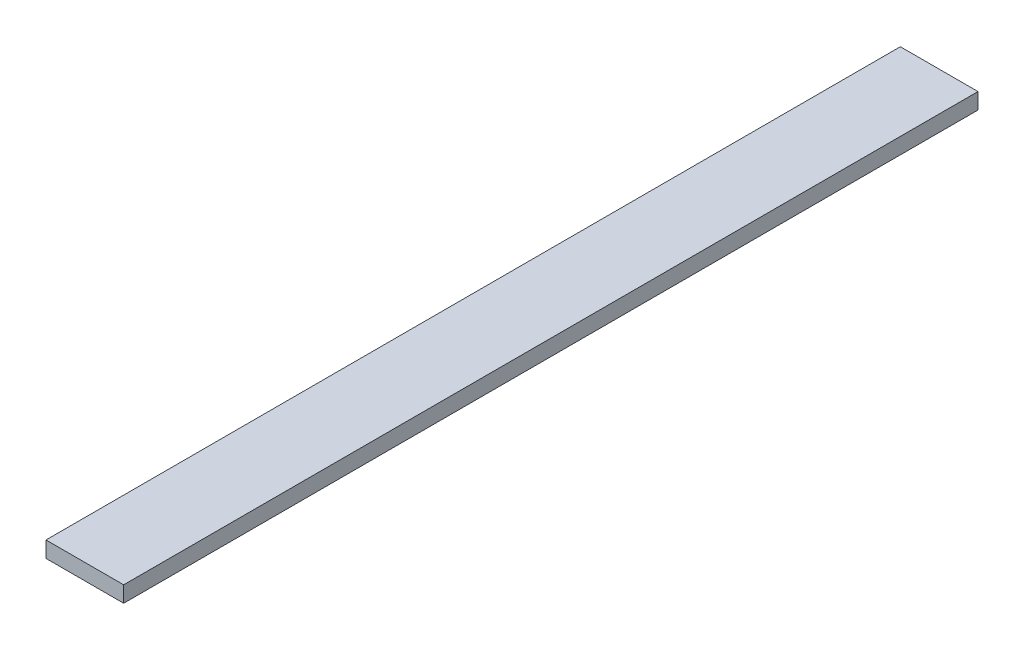
ISO-10303-21;
HEADER;
FILE_DESCRIPTION(('STEP AP214'),'2;1');
FILE_NAME('part.step','',(''),(''),'','','');
FILE_SCHEMA(('AUTOMOTIVE_DESIGN { 1 0 10303 214 1 1 1 1 }'));
ENDSEC;
DATA;
#1=APPLICATION_CONTEXT('core data for automotive mechanical design processes');
#2=APPLICATION_PROTOCOL_DEFINITION('international standard','automotive_design',2000,#1);
#3=PRODUCT_CONTEXT('',#1,'mechanical');
#4=PRODUCT('Part','Part','',(#3));
#5=PRODUCT_RELATED_PRODUCT_CATEGORY('part','',(#4));
#6=PRODUCT_DEFINITION_FORMATION('','',#4);
#7=PRODUCT_DEFINITION_CONTEXT('part definition',#1,'design');
#8=PRODUCT_DEFINITION('design','',#6,#7);
#9=PRODUCT_DEFINITION_SHAPE('','',#8);
#10=(LENGTH_UNIT() NAMED_UNIT(*) SI_UNIT(.MILLI.,.METRE.));
#11=(NAMED_UNIT(*) PLANE_ANGLE_UNIT() SI_UNIT($,.RADIAN.));
#12=(NAMED_UNIT(*) SI_UNIT($,.STERADIAN.) SOLID_ANGLE_UNIT());
#13=UNCERTAINTY_MEASURE_WITH_UNIT(LENGTH_MEASURE(1.E-05),#10,'distance_accuracy_value','');
#14=(GEOMETRIC_REPRESENTATION_CONTEXT(3) GLOBAL_UNCERTAINTY_ASSIGNED_CONTEXT((#13)) GLOBAL_UNIT_ASSIGNED_CONTEXT((#10,
#11,#12)) REPRESENTATION_CONTEXT('',''));
#15=CARTESIAN_POINT('',(0.,0.,0.));
#16=DIRECTION('',(0.,0.,1.));
#17=DIRECTION('',(1.,0.,0.));
#18=AXIS2_PLACEMENT_3D('',#15,#16,#17);
#19=CARTESIAN_POINT('',(0.,4.7625,0.));
#20=DIRECTION('',(1.,0.,0.));
#21=DIRECTION('',(0.,0.,-1.));
#22=AXIS2_PLACEMENT_3D('',#19,#20,#21);
#23=PLANE('',#22);
#24=DIRECTION('',(0.,0.,1.));
#25=VECTOR('',#24,1.);
#26=CARTESIAN_POINT('',(0.,0.,0.));
#27=LINE('',#26,#25);
#28=CARTESIAN_POINT('',(0.,0.,0.));
#29=VERTEX_POINT('',#28);
#30=CARTESIAN_POINT('',(0.,0.,254.));
#31=VERTEX_POINT('',#30);
#32=EDGE_CURVE('E96',#29,#31,#27,.T.);
#33=ORIENTED_EDGE('',*,*,#32,.T.);
#34=DIRECTION('',(0.,-1.,0.));
#35=VECTOR('',#34,1.);
#36=CARTESIAN_POINT('',(0.,4.7625,254.));
#37=LINE('',#36,#35);
#38=CARTESIAN_POINT('',(0.,4.7625,254.));
#39=VERTEX_POINT('',#38);
#40=EDGE_CURVE('E11',#39,#31,#37,.T.);
#41=ORIENTED_EDGE('',*,*,#40,.F.);
#42=DIRECTION('',(0.,0.,1.));
#43=VECTOR('',#42,1.);
#44=CARTESIAN_POINT('',(0.,4.7625,0.));
#45=LINE('',#44,#43);
#46=CARTESIAN_POINT('',(0.,4.7625,0.));
#47=VERTEX_POINT('',#46);
#48=EDGE_CURVE('E82',#47,#39,#45,.T.);
#49=ORIENTED_EDGE('',*,*,#48,.F.);
#50=DIRECTION('',(0.,-1.,0.));
#51=VECTOR('',#50,1.);
#52=CARTESIAN_POINT('',(0.,4.7625,0.));
#53=LINE('',#52,#51);
#54=EDGE_CURVE('E49',#47,#29,#53,.T.);
#55=ORIENTED_EDGE('',*,*,#54,.T.);
#56=EDGE_LOOP('',(#33,#41,#49,#55));
#57=FACE_BOUND('',#56,.T.);
#58=ADVANCED_FACE('F33',(#57),#23,.F.);
#59=CARTESIAN_POINT('',(0.,4.7625,254.));
#60=DIRECTION('',(0.,0.,-1.));
#61=DIRECTION('',(-1.,0.,0.));
#62=AXIS2_PLACEMENT_3D('',#59,#60,#61);
#63=PLANE('',#62);
#64=DIRECTION('',(1.,0.,0.));
#65=VECTOR('',#64,1.);
#66=CARTESIAN_POINT('',(0.,0.,254.));
#67=LINE('',#66,#65);
#68=CARTESIAN_POINT('',(23.0909090909091,0.,254.));
#69=VERTEX_POINT('',#68);
#70=EDGE_CURVE('E87',#31,#69,#67,.T.);
#71=ORIENTED_EDGE('',*,*,#70,.T.);
#72=DIRECTION('',(0.,-1.,0.));
#73=VECTOR('',#72,1.);
#74=CARTESIAN_POINT('',(23.0909090909091,4.7625,254.));
#75=LINE('',#74,#73);
#76=CARTESIAN_POINT('',(23.0909090909091,4.7625,254.));
#77=VERTEX_POINT('',#76);
#78=EDGE_CURVE('E41',#77,#69,#75,.T.);
#79=ORIENTED_EDGE('',*,*,#78,.F.);
#80=DIRECTION('',(1.,0.,0.));
#81=VECTOR('',#80,1.);
#82=CARTESIAN_POINT('',(0.,4.7625,254.));
#83=LINE('',#82,#81);
#84=EDGE_CURVE('E74',#39,#77,#83,.T.);
#85=ORIENTED_EDGE('',*,*,#84,.F.);
#86=ORIENTED_EDGE('',*,*,#40,.T.);
#87=EDGE_LOOP('',(#71,#79,#85,#86));
#88=FACE_BOUND('',#87,.T.);
#89=ADVANCED_FACE('F86',(#88),#63,.F.);
#90=CARTESIAN_POINT('',(23.0909090909091,4.7625,0.));
#91=DIRECTION('',(1.,0.,0.));
#92=DIRECTION('',(0.,0.,-1.));
#93=AXIS2_PLACEMENT_3D('',#90,#91,#92);
#94=PLANE('',#93);
#95=DIRECTION('',(0.,0.,1.));
#96=VECTOR('',#95,1.);
#97=CARTESIAN_POINT('',(23.0909090909091,0.,0.));
#98=LINE('',#97,#96);
#99=CARTESIAN_POINT('',(23.0909090909091,0.,0.));
#100=VERTEX_POINT('',#99);
#101=EDGE_CURVE('E99',#100,#69,#98,.T.);
#102=ORIENTED_EDGE('',*,*,#101,.F.);
#103=DIRECTION('',(0.,-1.,0.));
#104=VECTOR('',#103,1.);
#105=CARTESIAN_POINT('',(23.0909090909091,4.7625,0.));
#106=LINE('',#105,#104);
#107=CARTESIAN_POINT('',(23.0909090909091,4.7625,0.));
#108=VERTEX_POINT('',#107);
#109=EDGE_CURVE('E63',#108,#100,#106,.T.);
#110=ORIENTED_EDGE('',*,*,#109,.F.);
#111=DIRECTION('',(0.,0.,1.));
#112=VECTOR('',#111,1.);
#113=CARTESIAN_POINT('',(23.0909090909091,4.7625,0.));
#114=LINE('',#113,#112);
#115=EDGE_CURVE('E81',#108,#77,#114,.T.);
#116=ORIENTED_EDGE('',*,*,#115,.T.);
#117=ORIENTED_EDGE('',*,*,#78,.T.);
#118=EDGE_LOOP('',(#102,#110,#116,#117));
#119=FACE_BOUND('',#118,.T.);
#120=ADVANCED_FACE('F90',(#119),#94,.T.);
#121=CARTESIAN_POINT('',(0.,4.7625,0.));
#122=DIRECTION('',(0.,0.,-1.));
#123=DIRECTION('',(-1.,0.,0.));
#124=AXIS2_PLACEMENT_3D('',#121,#122,#123);
#125=PLANE('',#124);
#126=DIRECTION('',(1.,0.,0.));
#127=VECTOR('',#126,1.);
#128=CARTESIAN_POINT('',(0.,0.,0.));
#129=LINE('',#128,#127);
#130=EDGE_CURVE('E101',#29,#100,#129,.T.);
#131=ORIENTED_EDGE('',*,*,#130,.F.);
#132=ORIENTED_EDGE('',*,*,#54,.F.);
#133=DIRECTION('',(1.,0.,0.));
#134=VECTOR('',#133,1.);
#135=CARTESIAN_POINT('',(0.,4.7625,0.));
#136=LINE('',#135,#134);
#137=EDGE_CURVE('E91',#47,#108,#136,.T.);
#138=ORIENTED_EDGE('',*,*,#137,.T.);
#139=ORIENTED_EDGE('',*,*,#109,.T.);
#140=EDGE_LOOP('',(#131,#132,#138,#139));
#141=FACE_BOUND('',#140,.T.);
#142=ADVANCED_FACE('F107',(#141),#125,.T.);
#143=CARTESIAN_POINT('',(0.,4.7625,0.));
#144=DIRECTION('',(0.,1.,0.));
#145=DIRECTION('',(0.,0.,1.));
#146=AXIS2_PLACEMENT_3D('',#143,#144,#145);
#147=PLANE('',#146);
#148=ORIENTED_EDGE('',*,*,#48,.T.);
#149=ORIENTED_EDGE('',*,*,#84,.T.);
#150=ORIENTED_EDGE('',*,*,#115,.F.);
#151=ORIENTED_EDGE('',*,*,#137,.F.);
#152=EDGE_LOOP('',(#148,#149,#150,#151));
#153=FACE_BOUND('',#152,.T.);
#154=ADVANCED_FACE('F78',(#153),#147,.T.);
#155=CARTESIAN_POINT('',(0.,0.,0.));
#156=DIRECTION('',(0.,1.,0.));
#157=DIRECTION('',(0.,0.,1.));
#158=AXIS2_PLACEMENT_3D('',#155,#156,#157);
#159=PLANE('',#158);
#160=ORIENTED_EDGE('',*,*,#32,.F.);
#161=ORIENTED_EDGE('',*,*,#130,.T.);
#162=ORIENTED_EDGE('',*,*,#101,.T.);
#163=ORIENTED_EDGE('',*,*,#70,.F.);
#164=EDGE_LOOP('',(#160,#161,#162,#163));
#165=FACE_BOUND('',#164,.T.);
#166=ADVANCED_FACE('F106',(#165),#159,.F.);
#167=CLOSED_SHELL('',(#58,#89,#120,#142,#154,#166));
#168=MANIFOLD_SOLID_BREP('B2',#167);
#169=ADVANCED_BREP_SHAPE_REPRESENTATION('',(#18,#168),#14);
#170=SHAPE_DEFINITION_REPRESENTATION(#9,#169);
ENDSEC;
END-ISO-10303-21;
